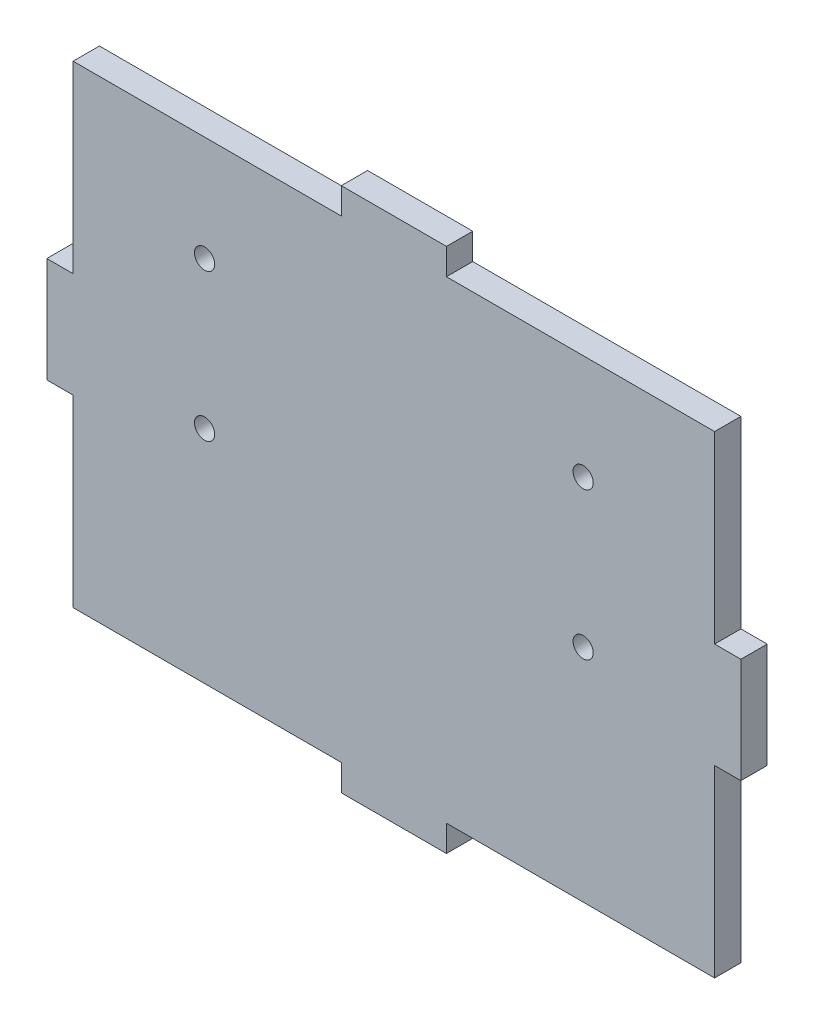
ISO-10303-21;
HEADER;
FILE_DESCRIPTION(('STEP AP214'),'2;1');
FILE_NAME('part.step','',(''),(''),'','','');
FILE_SCHEMA(('AUTOMOTIVE_DESIGN { 1 0 10303 214 1 1 1 1 }'));
ENDSEC;
DATA;
#1=APPLICATION_CONTEXT('core data for automotive mechanical design processes');
#2=APPLICATION_PROTOCOL_DEFINITION('international standard','automotive_design',2000,#1);
#3=PRODUCT_CONTEXT('',#1,'mechanical');
#4=PRODUCT('Part','Part','',(#3));
#5=PRODUCT_RELATED_PRODUCT_CATEGORY('part','',(#4));
#6=PRODUCT_DEFINITION_FORMATION('','',#4);
#7=PRODUCT_DEFINITION_CONTEXT('part definition',#1,'design');
#8=PRODUCT_DEFINITION('design','',#6,#7);
#9=PRODUCT_DEFINITION_SHAPE('','',#8);
#10=(LENGTH_UNIT() NAMED_UNIT(*) SI_UNIT(.MILLI.,.METRE.));
#11=(NAMED_UNIT(*) PLANE_ANGLE_UNIT() SI_UNIT($,.RADIAN.));
#12=(NAMED_UNIT(*) SI_UNIT($,.STERADIAN.) SOLID_ANGLE_UNIT());
#13=UNCERTAINTY_MEASURE_WITH_UNIT(LENGTH_MEASURE(1.E-05),#10,'distance_accuracy_value','');
#14=(GEOMETRIC_REPRESENTATION_CONTEXT(3) GLOBAL_UNCERTAINTY_ASSIGNED_CONTEXT((#13)) GLOBAL_UNIT_ASSIGNED_CONTEXT((#10,
#11,#12)) REPRESENTATION_CONTEXT('',''));
#15=CARTESIAN_POINT('',(0.,0.,0.));
#16=DIRECTION('',(0.,0.,1.));
#17=DIRECTION('',(1.,0.,0.));
#18=AXIS2_PLACEMENT_3D('',#15,#16,#17);
#19=CARTESIAN_POINT('',(38.735,6.35,3.175));
#20=DIRECTION('',(-1.,0.,0.));
#21=DIRECTION('',(0.,0.,1.));
#22=AXIS2_PLACEMENT_3D('',#19,#20,#21);
#23=PLANE('',#22);
#24=DIRECTION('',(0.,1.,0.));
#25=VECTOR('',#24,1.);
#26=CARTESIAN_POINT('',(38.735,6.35,0.));
#27=LINE('',#26,#25);
#28=CARTESIAN_POINT('',(38.735,6.35,0.));
#29=VERTEX_POINT('',#28);
#30=CARTESIAN_POINT('',(38.735,28.575,0.));
#31=VERTEX_POINT('',#30);
#32=EDGE_CURVE('E212',#29,#31,#27,.T.);
#33=ORIENTED_EDGE('',*,*,#32,.T.);
#34=DIRECTION('',(0.,0.,-1.));
#35=VECTOR('',#34,1.);
#36=CARTESIAN_POINT('',(38.735,28.575,3.175));
#37=LINE('',#36,#35);
#38=CARTESIAN_POINT('',(38.735,28.575,3.175));
#39=VERTEX_POINT('',#38);
#40=EDGE_CURVE('E11',#39,#31,#37,.T.);
#41=ORIENTED_EDGE('',*,*,#40,.F.);
#42=DIRECTION('',(0.,1.,0.));
#43=VECTOR('',#42,1.);
#44=CARTESIAN_POINT('',(38.735,6.35,3.175));
#45=LINE('',#44,#43);
#46=CARTESIAN_POINT('',(38.735,6.35,3.175));
#47=VERTEX_POINT('',#46);
#48=EDGE_CURVE('E271',#47,#39,#45,.T.);
#49=ORIENTED_EDGE('',*,*,#48,.F.);
#50=DIRECTION('',(0.,0.,-1.));
#51=VECTOR('',#50,1.);
#52=CARTESIAN_POINT('',(38.735,6.35,3.175));
#53=LINE('',#52,#51);
#54=EDGE_CURVE('E208',#47,#29,#53,.T.);
#55=ORIENTED_EDGE('',*,*,#54,.T.);
#56=EDGE_LOOP('',(#33,#41,#49,#55));
#57=FACE_BOUND('',#56,.T.);
#58=ADVANCED_FACE('F39',(#57),#23,.F.);
#59=CARTESIAN_POINT('',(6.34999999999999,28.575,3.175));
#60=DIRECTION('',(0.,-1.,0.));
#61=DIRECTION('',(0.,0.,-1.));
#62=AXIS2_PLACEMENT_3D('',#59,#60,#61);
#63=PLANE('',#62);
#64=DIRECTION('',(-1.,0.,0.));
#65=VECTOR('',#64,1.);
#66=CARTESIAN_POINT('',(6.34999999999999,28.575,0.));
#67=LINE('',#66,#65);
#68=CARTESIAN_POINT('',(6.34999999999999,28.575,0.));
#69=VERTEX_POINT('',#68);
#70=EDGE_CURVE('E216',#31,#69,#67,.T.);
#71=ORIENTED_EDGE('',*,*,#70,.T.);
#72=DIRECTION('',(0.,0.,-1.));
#73=VECTOR('',#72,1.);
#74=CARTESIAN_POINT('',(6.34999999999999,28.575,3.175));
#75=LINE('',#74,#73);
#76=CARTESIAN_POINT('',(6.34999999999999,28.575,3.175));
#77=VERTEX_POINT('',#76);
#78=EDGE_CURVE('E48',#77,#69,#75,.T.);
#79=ORIENTED_EDGE('',*,*,#78,.F.);
#80=DIRECTION('',(-1.,0.,0.));
#81=VECTOR('',#80,1.);
#82=CARTESIAN_POINT('',(6.34999999999999,28.575,3.175));
#83=LINE('',#82,#81);
#84=EDGE_CURVE('E135',#39,#77,#83,.T.);
#85=ORIENTED_EDGE('',*,*,#84,.F.);
#86=ORIENTED_EDGE('',*,*,#40,.T.);
#87=EDGE_LOOP('',(#71,#79,#85,#86));
#88=FACE_BOUND('',#87,.T.);
#89=ADVANCED_FACE('F422',(#88),#63,.F.);
#90=CARTESIAN_POINT('',(6.34999999999999,31.75,3.175));
#91=DIRECTION('',(-1.,0.,0.));
#92=DIRECTION('',(0.,0.,1.));
#93=AXIS2_PLACEMENT_3D('',#90,#91,#92);
#94=PLANE('',#93);
#95=DIRECTION('',(0.,1.,0.));
#96=VECTOR('',#95,1.);
#97=CARTESIAN_POINT('',(6.34999999999999,31.75,0.));
#98=LINE('',#97,#96);
#99=CARTESIAN_POINT('',(6.34999999999999,31.75,0.));
#100=VERTEX_POINT('',#99);
#101=EDGE_CURVE('E220',#69,#100,#98,.T.);
#102=ORIENTED_EDGE('',*,*,#101,.T.);
#103=DIRECTION('',(0.,0.,-1.));
#104=VECTOR('',#103,1.);
#105=CARTESIAN_POINT('',(6.34999999999999,31.75,3.175));
#106=LINE('',#105,#104);
#107=CARTESIAN_POINT('',(6.34999999999999,31.75,3.175));
#108=VERTEX_POINT('',#107);
#109=EDGE_CURVE('E330',#108,#100,#106,.T.);
#110=ORIENTED_EDGE('',*,*,#109,.F.);
#111=DIRECTION('',(0.,1.,0.));
#112=VECTOR('',#111,1.);
#113=CARTESIAN_POINT('',(6.34999999999999,31.75,3.175));
#114=LINE('',#113,#112);
#115=EDGE_CURVE('E340',#77,#108,#114,.T.);
#116=ORIENTED_EDGE('',*,*,#115,.F.);
#117=ORIENTED_EDGE('',*,*,#78,.T.);
#118=EDGE_LOOP('',(#102,#110,#116,#117));
#119=FACE_BOUND('',#118,.T.);
#120=ADVANCED_FACE('F338',(#119),#94,.F.);
#121=CARTESIAN_POINT('',(-6.35,31.75,3.175));
#122=DIRECTION('',(0.,-1.,0.));
#123=DIRECTION('',(0.,0.,-1.));
#124=AXIS2_PLACEMENT_3D('',#121,#122,#123);
#125=PLANE('',#124);
#126=DIRECTION('',(-1.,0.,0.));
#127=VECTOR('',#126,1.);
#128=CARTESIAN_POINT('',(-6.35,31.75,0.));
#129=LINE('',#128,#127);
#130=CARTESIAN_POINT('',(-6.35,31.75,0.));
#131=VERTEX_POINT('',#130);
#132=EDGE_CURVE('E223',#100,#131,#129,.T.);
#133=ORIENTED_EDGE('',*,*,#132,.T.);
#134=DIRECTION('',(0.,0.,-1.));
#135=VECTOR('',#134,1.);
#136=CARTESIAN_POINT('',(-6.35,31.75,3.175));
#137=LINE('',#136,#135);
#138=CARTESIAN_POINT('',(-6.35,31.75,3.175));
#139=VERTEX_POINT('',#138);
#140=EDGE_CURVE('E326',#139,#131,#137,.T.);
#141=ORIENTED_EDGE('',*,*,#140,.F.);
#142=DIRECTION('',(-1.,0.,0.));
#143=VECTOR('',#142,1.);
#144=CARTESIAN_POINT('',(-6.35,31.75,3.175));
#145=LINE('',#144,#143);
#146=EDGE_CURVE('E359',#108,#139,#145,.T.);
#147=ORIENTED_EDGE('',*,*,#146,.F.);
#148=ORIENTED_EDGE('',*,*,#109,.T.);
#149=EDGE_LOOP('',(#133,#141,#147,#148));
#150=FACE_BOUND('',#149,.T.);
#151=ADVANCED_FACE('F349',(#150),#125,.F.);
#152=CARTESIAN_POINT('',(-6.35,28.575,3.175));
#153=DIRECTION('',(1.,0.,0.));
#154=DIRECTION('',(0.,0.,-1.));
#155=AXIS2_PLACEMENT_3D('',#152,#153,#154);
#156=PLANE('',#155);
#157=DIRECTION('',(0.,-1.,0.));
#158=VECTOR('',#157,1.);
#159=CARTESIAN_POINT('',(-6.35,28.575,0.));
#160=LINE('',#159,#158);
#161=CARTESIAN_POINT('',(-6.35,28.575,0.));
#162=VERTEX_POINT('',#161);
#163=EDGE_CURVE('E226',#131,#162,#160,.T.);
#164=ORIENTED_EDGE('',*,*,#163,.T.);
#165=DIRECTION('',(0.,0.,-1.));
#166=VECTOR('',#165,1.);
#167=CARTESIAN_POINT('',(-6.35,28.575,3.175));
#168=LINE('',#167,#166);
#169=CARTESIAN_POINT('',(-6.35,28.575,3.175));
#170=VERTEX_POINT('',#169);
#171=EDGE_CURVE('E322',#170,#162,#168,.T.);
#172=ORIENTED_EDGE('',*,*,#171,.F.);
#173=DIRECTION('',(0.,-1.,0.));
#174=VECTOR('',#173,1.);
#175=CARTESIAN_POINT('',(-6.35,28.575,3.175));
#176=LINE('',#175,#174);
#177=EDGE_CURVE('E355',#139,#170,#176,.T.);
#178=ORIENTED_EDGE('',*,*,#177,.F.);
#179=ORIENTED_EDGE('',*,*,#140,.T.);
#180=EDGE_LOOP('',(#164,#172,#178,#179));
#181=FACE_BOUND('',#180,.T.);
#182=ADVANCED_FACE('F353',(#181),#156,.F.);
#183=CARTESIAN_POINT('',(-38.735,28.575,3.175));
#184=DIRECTION('',(0.,-1.,0.));
#185=DIRECTION('',(1.,0.,0.));
#186=AXIS2_PLACEMENT_3D('',#183,#184,#185);
#187=PLANE('',#186);
#188=DIRECTION('',(-1.,0.,0.));
#189=VECTOR('',#188,1.);
#190=CARTESIAN_POINT('',(-38.735,28.575,0.));
#191=LINE('',#190,#189);
#192=CARTESIAN_POINT('',(-38.735,28.575,0.));
#193=VERTEX_POINT('',#192);
#194=EDGE_CURVE('E229',#162,#193,#191,.T.);
#195=ORIENTED_EDGE('',*,*,#194,.T.);
#196=DIRECTION('',(0.,0.,-1.));
#197=VECTOR('',#196,1.);
#198=CARTESIAN_POINT('',(-38.735,28.575,3.175));
#199=LINE('',#198,#197);
#200=CARTESIAN_POINT('',(-38.735,28.575,3.175));
#201=VERTEX_POINT('',#200);
#202=EDGE_CURVE('E318',#201,#193,#199,.T.);
#203=ORIENTED_EDGE('',*,*,#202,.F.);
#204=DIRECTION('',(-1.,0.,0.));
#205=VECTOR('',#204,1.);
#206=CARTESIAN_POINT('',(-38.735,28.575,3.175));
#207=LINE('',#206,#205);
#208=EDGE_CURVE('E358',#170,#201,#207,.T.);
#209=ORIENTED_EDGE('',*,*,#208,.F.);
#210=ORIENTED_EDGE('',*,*,#171,.T.);
#211=EDGE_LOOP('',(#195,#203,#209,#210));
#212=FACE_BOUND('',#211,.T.);
#213=ADVANCED_FACE('F435',(#212),#187,.F.);
#214=CARTESIAN_POINT('',(-38.735,6.35000000000001,3.175));
#215=DIRECTION('',(1.,0.,0.));
#216=DIRECTION('',(0.,0.,-1.));
#217=AXIS2_PLACEMENT_3D('',#214,#215,#216);
#218=PLANE('',#217);
#219=DIRECTION('',(0.,-1.,0.));
#220=VECTOR('',#219,1.);
#221=CARTESIAN_POINT('',(-38.735,6.35000000000001,0.));
#222=LINE('',#221,#220);
#223=CARTESIAN_POINT('',(-38.735,6.35000000000001,0.));
#224=VERTEX_POINT('',#223);
#225=EDGE_CURVE('E232',#193,#224,#222,.T.);
#226=ORIENTED_EDGE('',*,*,#225,.T.);
#227=DIRECTION('',(0.,0.,-1.));
#228=VECTOR('',#227,1.);
#229=CARTESIAN_POINT('',(-38.735,6.35000000000001,3.175));
#230=LINE('',#229,#228);
#231=CARTESIAN_POINT('',(-38.735,6.35000000000001,3.175));
#232=VERTEX_POINT('',#231);
#233=EDGE_CURVE('E314',#232,#224,#230,.T.);
#234=ORIENTED_EDGE('',*,*,#233,.F.);
#235=DIRECTION('',(0.,-1.,0.));
#236=VECTOR('',#235,1.);
#237=CARTESIAN_POINT('',(-38.735,6.35000000000001,3.175));
#238=LINE('',#237,#236);
#239=EDGE_CURVE('E363',#201,#232,#238,.T.);
#240=ORIENTED_EDGE('',*,*,#239,.F.);
#241=ORIENTED_EDGE('',*,*,#202,.T.);
#242=EDGE_LOOP('',(#226,#234,#240,#241));
#243=FACE_BOUND('',#242,.T.);
#244=ADVANCED_FACE('F438',(#243),#218,.F.);
#245=CARTESIAN_POINT('',(-38.735,6.35000000000001,3.175));
#246=DIRECTION('',(0.,-1.,0.));
#247=DIRECTION('',(1.,0.,0.));
#248=AXIS2_PLACEMENT_3D('',#245,#246,#247);
#249=PLANE('',#248);
#250=DIRECTION('',(-1.,0.,0.));
#251=VECTOR('',#250,1.);
#252=CARTESIAN_POINT('',(-38.735,6.35000000000001,0.));
#253=LINE('',#252,#251);
#254=CARTESIAN_POINT('',(-41.91,6.34999999999999,0.));
#255=VERTEX_POINT('',#254);
#256=EDGE_CURVE('E235',#224,#255,#253,.T.);
#257=ORIENTED_EDGE('',*,*,#256,.T.);
#258=DIRECTION('',(0.,0.,-1.));
#259=VECTOR('',#258,1.);
#260=CARTESIAN_POINT('',(-41.91,6.34999999999999,3.175));
#261=LINE('',#260,#259);
#262=CARTESIAN_POINT('',(-41.91,6.34999999999999,3.175));
#263=VERTEX_POINT('',#262);
#264=EDGE_CURVE('E310',#263,#255,#261,.T.);
#265=ORIENTED_EDGE('',*,*,#264,.F.);
#266=DIRECTION('',(-1.,0.,0.));
#267=VECTOR('',#266,1.);
#268=CARTESIAN_POINT('',(-38.735,6.35000000000001,3.175));
#269=LINE('',#268,#267);
#270=EDGE_CURVE('E370',#232,#263,#269,.T.);
#271=ORIENTED_EDGE('',*,*,#270,.F.);
#272=ORIENTED_EDGE('',*,*,#233,.T.);
#273=EDGE_LOOP('',(#257,#265,#271,#272));
#274=FACE_BOUND('',#273,.T.);
#275=ADVANCED_FACE('F442',(#274),#249,.F.);
#276=CARTESIAN_POINT('',(-41.91,6.34999999999999,3.175));
#277=DIRECTION('',(1.,0.,0.));
#278=DIRECTION('',(0.,0.,-1.));
#279=AXIS2_PLACEMENT_3D('',#276,#277,#278);
#280=PLANE('',#279);
#281=DIRECTION('',(0.,-1.,0.));
#282=VECTOR('',#281,1.);
#283=CARTESIAN_POINT('',(-41.91,6.34999999999999,0.));
#284=LINE('',#283,#282);
#285=CARTESIAN_POINT('',(-41.91,-6.35,0.));
#286=VERTEX_POINT('',#285);
#287=EDGE_CURVE('E238',#255,#286,#284,.T.);
#288=ORIENTED_EDGE('',*,*,#287,.T.);
#289=DIRECTION('',(0.,0.,-1.));
#290=VECTOR('',#289,1.);
#291=CARTESIAN_POINT('',(-41.91,-6.35,3.175));
#292=LINE('',#291,#290);
#293=CARTESIAN_POINT('',(-41.91,-6.35,3.175));
#294=VERTEX_POINT('',#293);
#295=EDGE_CURVE('E306',#294,#286,#292,.T.);
#296=ORIENTED_EDGE('',*,*,#295,.F.);
#297=DIRECTION('',(0.,-1.,0.));
#298=VECTOR('',#297,1.);
#299=CARTESIAN_POINT('',(-41.91,6.34999999999999,3.175));
#300=LINE('',#299,#298);
#301=EDGE_CURVE('E373',#263,#294,#300,.T.);
#302=ORIENTED_EDGE('',*,*,#301,.F.);
#303=ORIENTED_EDGE('',*,*,#264,.T.);
#304=EDGE_LOOP('',(#288,#296,#302,#303));
#305=FACE_BOUND('',#304,.T.);
#306=ADVANCED_FACE('F446',(#305),#280,.F.);
#307=CARTESIAN_POINT('',(-41.91,-6.35,3.175));
#308=DIRECTION('',(0.,1.,0.));
#309=DIRECTION('',(-1.,0.,0.));
#310=AXIS2_PLACEMENT_3D('',#307,#308,#309);
#311=PLANE('',#310);
#312=DIRECTION('',(1.,0.,0.));
#313=VECTOR('',#312,1.);
#314=CARTESIAN_POINT('',(-41.91,-6.35,0.));
#315=LINE('',#314,#313);
#316=CARTESIAN_POINT('',(-38.735,-6.35,0.));
#317=VERTEX_POINT('',#316);
#318=EDGE_CURVE('E241',#286,#317,#315,.T.);
#319=ORIENTED_EDGE('',*,*,#318,.T.);
#320=DIRECTION('',(0.,0.,-1.));
#321=VECTOR('',#320,1.);
#322=CARTESIAN_POINT('',(-38.735,-6.35,3.175));
#323=LINE('',#322,#321);
#324=CARTESIAN_POINT('',(-38.735,-6.35,3.175));
#325=VERTEX_POINT('',#324);
#326=EDGE_CURVE('E302',#325,#317,#323,.T.);
#327=ORIENTED_EDGE('',*,*,#326,.F.);
#328=DIRECTION('',(1.,0.,0.));
#329=VECTOR('',#328,1.);
#330=CARTESIAN_POINT('',(-41.91,-6.35,3.175));
#331=LINE('',#330,#329);
#332=EDGE_CURVE('E376',#294,#325,#331,.T.);
#333=ORIENTED_EDGE('',*,*,#332,.F.);
#334=ORIENTED_EDGE('',*,*,#295,.T.);
#335=EDGE_LOOP('',(#319,#327,#333,#334));
#336=FACE_BOUND('',#335,.T.);
#337=ADVANCED_FACE('F450',(#336),#311,.F.);
#338=CARTESIAN_POINT('',(-38.735,-28.575,3.175));
#339=DIRECTION('',(1.,0.,0.));
#340=DIRECTION('',(0.,0.,-1.));
#341=AXIS2_PLACEMENT_3D('',#338,#339,#340);
#342=PLANE('',#341);
#343=DIRECTION('',(0.,-1.,0.));
#344=VECTOR('',#343,1.);
#345=CARTESIAN_POINT('',(-38.735,-28.575,0.));
#346=LINE('',#345,#344);
#347=CARTESIAN_POINT('',(-38.735,-28.575,0.));
#348=VERTEX_POINT('',#347);
#349=EDGE_CURVE('E244',#317,#348,#346,.T.);
#350=ORIENTED_EDGE('',*,*,#349,.T.);
#351=DIRECTION('',(0.,0.,-1.));
#352=VECTOR('',#351,1.);
#353=CARTESIAN_POINT('',(-38.735,-28.575,3.175));
#354=LINE('',#353,#352);
#355=CARTESIAN_POINT('',(-38.735,-28.575,3.175));
#356=VERTEX_POINT('',#355);
#357=EDGE_CURVE('E298',#356,#348,#354,.T.);
#358=ORIENTED_EDGE('',*,*,#357,.F.);
#359=DIRECTION('',(0.,-1.,0.));
#360=VECTOR('',#359,1.);
#361=CARTESIAN_POINT('',(-38.735,-28.575,3.175));
#362=LINE('',#361,#360);
#363=EDGE_CURVE('E379',#325,#356,#362,.T.);
#364=ORIENTED_EDGE('',*,*,#363,.F.);
#365=ORIENTED_EDGE('',*,*,#326,.T.);
#366=EDGE_LOOP('',(#350,#358,#364,#365));
#367=FACE_BOUND('',#366,.T.);
#368=ADVANCED_FACE('F454',(#367),#342,.F.);
#369=CARTESIAN_POINT('',(-38.735,-28.575,3.175));
#370=DIRECTION('',(0.,1.,0.));
#371=DIRECTION('',(0.,0.,1.));
#372=AXIS2_PLACEMENT_3D('',#369,#370,#371);
#373=PLANE('',#372);
#374=DIRECTION('',(1.,0.,0.));
#375=VECTOR('',#374,1.);
#376=CARTESIAN_POINT('',(-38.735,-28.575,0.));
#377=LINE('',#376,#375);
#378=CARTESIAN_POINT('',(-6.35000000000001,-28.575,0.));
#379=VERTEX_POINT('',#378);
#380=EDGE_CURVE('E247',#348,#379,#377,.T.);
#381=ORIENTED_EDGE('',*,*,#380,.T.);
#382=DIRECTION('',(0.,0.,-1.));
#383=VECTOR('',#382,1.);
#384=CARTESIAN_POINT('',(-6.35000000000001,-28.575,3.175));
#385=LINE('',#384,#383);
#386=CARTESIAN_POINT('',(-6.35000000000001,-28.575,3.175));
#387=VERTEX_POINT('',#386);
#388=EDGE_CURVE('E294',#387,#379,#385,.T.);
#389=ORIENTED_EDGE('',*,*,#388,.F.);
#390=DIRECTION('',(1.,0.,0.));
#391=VECTOR('',#390,1.);
#392=CARTESIAN_POINT('',(-38.735,-28.575,3.175));
#393=LINE('',#392,#391);
#394=EDGE_CURVE('E382',#356,#387,#393,.T.);
#395=ORIENTED_EDGE('',*,*,#394,.F.);
#396=ORIENTED_EDGE('',*,*,#357,.T.);
#397=EDGE_LOOP('',(#381,#389,#395,#396));
#398=FACE_BOUND('',#397,.T.);
#399=ADVANCED_FACE('F458',(#398),#373,.F.);
#400=CARTESIAN_POINT('',(-6.35000000000001,-28.575,3.175));
#401=DIRECTION('',(1.,0.,0.));
#402=DIRECTION('',(0.,0.,-1.));
#403=AXIS2_PLACEMENT_3D('',#400,#401,#402);
#404=PLANE('',#403);
#405=DIRECTION('',(0.,-1.,0.));
#406=VECTOR('',#405,1.);
#407=CARTESIAN_POINT('',(-6.35000000000001,-28.575,0.));
#408=LINE('',#407,#406);
#409=CARTESIAN_POINT('',(-6.35000000000001,-31.75,0.));
#410=VERTEX_POINT('',#409);
#411=EDGE_CURVE('E250',#379,#410,#408,.T.);
#412=ORIENTED_EDGE('',*,*,#411,.T.);
#413=DIRECTION('',(0.,0.,-1.));
#414=VECTOR('',#413,1.);
#415=CARTESIAN_POINT('',(-6.35000000000001,-31.75,3.175));
#416=LINE('',#415,#414);
#417=CARTESIAN_POINT('',(-6.35000000000001,-31.75,3.175));
#418=VERTEX_POINT('',#417);
#419=EDGE_CURVE('E290',#418,#410,#416,.T.);
#420=ORIENTED_EDGE('',*,*,#419,.F.);
#421=DIRECTION('',(0.,-1.,0.));
#422=VECTOR('',#421,1.);
#423=CARTESIAN_POINT('',(-6.35000000000001,-28.575,3.175));
#424=LINE('',#423,#422);
#425=EDGE_CURVE('E385',#387,#418,#424,.T.);
#426=ORIENTED_EDGE('',*,*,#425,.F.);
#427=ORIENTED_EDGE('',*,*,#388,.T.);
#428=EDGE_LOOP('',(#412,#420,#426,#427));
#429=FACE_BOUND('',#428,.T.);
#430=ADVANCED_FACE('F462',(#429),#404,.F.);
#431=CARTESIAN_POINT('',(-6.35000000000001,-31.75,3.175));
#432=DIRECTION('',(0.,1.,0.));
#433=DIRECTION('',(-1.,0.,0.));
#434=AXIS2_PLACEMENT_3D('',#431,#432,#433);
#435=PLANE('',#434);
#436=DIRECTION('',(1.,0.,0.));
#437=VECTOR('',#436,1.);
#438=CARTESIAN_POINT('',(-6.35000000000001,-31.75,0.));
#439=LINE('',#438,#437);
#440=CARTESIAN_POINT('',(6.34999999999999,-31.75,0.));
#441=VERTEX_POINT('',#440);
#442=EDGE_CURVE('E253',#410,#441,#439,.T.);
#443=ORIENTED_EDGE('',*,*,#442,.T.);
#444=DIRECTION('',(0.,0.,-1.));
#445=VECTOR('',#444,1.);
#446=CARTESIAN_POINT('',(6.34999999999999,-31.75,3.175));
#447=LINE('',#446,#445);
#448=CARTESIAN_POINT('',(6.34999999999999,-31.75,3.175));
#449=VERTEX_POINT('',#448);
#450=EDGE_CURVE('E286',#449,#441,#447,.T.);
#451=ORIENTED_EDGE('',*,*,#450,.F.);
#452=DIRECTION('',(1.,0.,0.));
#453=VECTOR('',#452,1.);
#454=CARTESIAN_POINT('',(-6.35000000000001,-31.75,3.175));
#455=LINE('',#454,#453);
#456=EDGE_CURVE('E388',#418,#449,#455,.T.);
#457=ORIENTED_EDGE('',*,*,#456,.F.);
#458=ORIENTED_EDGE('',*,*,#419,.T.);
#459=EDGE_LOOP('',(#443,#451,#457,#458));
#460=FACE_BOUND('',#459,.T.);
#461=ADVANCED_FACE('F466',(#460),#435,.F.);
#462=CARTESIAN_POINT('',(6.34999999999999,-31.75,3.175));
#463=DIRECTION('',(-1.,0.,0.));
#464=DIRECTION('',(0.,0.,1.));
#465=AXIS2_PLACEMENT_3D('',#462,#463,#464);
#466=PLANE('',#465);
#467=DIRECTION('',(0.,1.,0.));
#468=VECTOR('',#467,1.);
#469=CARTESIAN_POINT('',(6.34999999999999,-31.75,0.));
#470=LINE('',#469,#468);
#471=CARTESIAN_POINT('',(6.34999999999999,-28.575,0.));
#472=VERTEX_POINT('',#471);
#473=EDGE_CURVE('E256',#441,#472,#470,.T.);
#474=ORIENTED_EDGE('',*,*,#473,.T.);
#475=DIRECTION('',(0.,0.,-1.));
#476=VECTOR('',#475,1.);
#477=CARTESIAN_POINT('',(6.34999999999999,-28.575,3.175));
#478=LINE('',#477,#476);
#479=CARTESIAN_POINT('',(6.34999999999999,-28.575,3.175));
#480=VERTEX_POINT('',#479);
#481=EDGE_CURVE('E282',#480,#472,#478,.T.);
#482=ORIENTED_EDGE('',*,*,#481,.F.);
#483=DIRECTION('',(0.,1.,0.));
#484=VECTOR('',#483,1.);
#485=CARTESIAN_POINT('',(6.34999999999999,-31.75,3.175));
#486=LINE('',#485,#484);
#487=EDGE_CURVE('E391',#449,#480,#486,.T.);
#488=ORIENTED_EDGE('',*,*,#487,.F.);
#489=ORIENTED_EDGE('',*,*,#450,.T.);
#490=EDGE_LOOP('',(#474,#482,#488,#489));
#491=FACE_BOUND('',#490,.T.);
#492=ADVANCED_FACE('F470',(#491),#466,.F.);
#493=CARTESIAN_POINT('',(6.34999999999999,-28.575,3.175));
#494=DIRECTION('',(0.,1.,0.));
#495=DIRECTION('',(0.,0.,1.));
#496=AXIS2_PLACEMENT_3D('',#493,#494,#495);
#497=PLANE('',#496);
#498=DIRECTION('',(1.,0.,0.));
#499=VECTOR('',#498,1.);
#500=CARTESIAN_POINT('',(6.34999999999999,-28.575,0.));
#501=LINE('',#500,#499);
#502=CARTESIAN_POINT('',(38.735,-28.575,0.));
#503=VERTEX_POINT('',#502);
#504=EDGE_CURVE('E259',#472,#503,#501,.T.);
#505=ORIENTED_EDGE('',*,*,#504,.T.);
#506=DIRECTION('',(0.,0.,-1.));
#507=VECTOR('',#506,1.);
#508=CARTESIAN_POINT('',(38.735,-28.575,3.175));
#509=LINE('',#508,#507);
#510=CARTESIAN_POINT('',(38.735,-28.575,3.175));
#511=VERTEX_POINT('',#510);
#512=EDGE_CURVE('E278',#511,#503,#509,.T.);
#513=ORIENTED_EDGE('',*,*,#512,.F.);
#514=DIRECTION('',(1.,0.,0.));
#515=VECTOR('',#514,1.);
#516=CARTESIAN_POINT('',(6.34999999999999,-28.575,3.175));
#517=LINE('',#516,#515);
#518=EDGE_CURVE('E394',#480,#511,#517,.T.);
#519=ORIENTED_EDGE('',*,*,#518,.F.);
#520=ORIENTED_EDGE('',*,*,#481,.T.);
#521=EDGE_LOOP('',(#505,#513,#519,#520));
#522=FACE_BOUND('',#521,.T.);
#523=ADVANCED_FACE('F402',(#522),#497,.F.);
#524=CARTESIAN_POINT('',(38.735,-28.575,3.175));
#525=DIRECTION('',(-1.,0.,0.));
#526=DIRECTION('',(0.,0.,1.));
#527=AXIS2_PLACEMENT_3D('',#524,#525,#526);
#528=PLANE('',#527);
#529=DIRECTION('',(0.,1.,0.));
#530=VECTOR('',#529,1.);
#531=CARTESIAN_POINT('',(38.735,-28.575,0.));
#532=LINE('',#531,#530);
#533=CARTESIAN_POINT('',(38.735,-6.35,0.));
#534=VERTEX_POINT('',#533);
#535=EDGE_CURVE('E262',#503,#534,#532,.T.);
#536=ORIENTED_EDGE('',*,*,#535,.T.);
#537=DIRECTION('',(0.,0.,-1.));
#538=VECTOR('',#537,1.);
#539=CARTESIAN_POINT('',(38.735,-6.35,3.175));
#540=LINE('',#539,#538);
#541=CARTESIAN_POINT('',(38.735,-6.35,3.175));
#542=VERTEX_POINT('',#541);
#543=EDGE_CURVE('E201',#542,#534,#540,.T.);
#544=ORIENTED_EDGE('',*,*,#543,.F.);
#545=DIRECTION('',(0.,1.,0.));
#546=VECTOR('',#545,1.);
#547=CARTESIAN_POINT('',(38.735,-28.575,3.175));
#548=LINE('',#547,#546);
#549=EDGE_CURVE('E190',#511,#542,#548,.T.);
#550=ORIENTED_EDGE('',*,*,#549,.F.);
#551=ORIENTED_EDGE('',*,*,#512,.T.);
#552=EDGE_LOOP('',(#536,#544,#550,#551));
#553=FACE_BOUND('',#552,.T.);
#554=ADVANCED_FACE('F406',(#553),#528,.F.);
#555=CARTESIAN_POINT('',(41.91,-6.35,3.175));
#556=DIRECTION('',(0.,1.,0.));
#557=DIRECTION('',(-1.,0.,0.));
#558=AXIS2_PLACEMENT_3D('',#555,#556,#557);
#559=PLANE('',#558);
#560=DIRECTION('',(1.,0.,0.));
#561=VECTOR('',#560,1.);
#562=CARTESIAN_POINT('',(41.91,-6.35,0.));
#563=LINE('',#562,#561);
#564=CARTESIAN_POINT('',(41.91,-6.35,0.));
#565=VERTEX_POINT('',#564);
#566=EDGE_CURVE('E199',#534,#565,#563,.T.);
#567=ORIENTED_EDGE('',*,*,#566,.T.);
#568=DIRECTION('',(0.,0.,-1.));
#569=VECTOR('',#568,1.);
#570=CARTESIAN_POINT('',(41.91,-6.35,3.175));
#571=LINE('',#570,#569);
#572=CARTESIAN_POINT('',(41.91,-6.35,3.175));
#573=VERTEX_POINT('',#572);
#574=EDGE_CURVE('E196',#573,#565,#571,.T.);
#575=ORIENTED_EDGE('',*,*,#574,.F.);
#576=DIRECTION('',(1.,0.,0.));
#577=VECTOR('',#576,1.);
#578=CARTESIAN_POINT('',(41.91,-6.35,3.175));
#579=LINE('',#578,#577);
#580=EDGE_CURVE('E184',#542,#573,#579,.T.);
#581=ORIENTED_EDGE('',*,*,#580,.F.);
#582=ORIENTED_EDGE('',*,*,#543,.T.);
#583=EDGE_LOOP('',(#567,#575,#581,#582));
#584=FACE_BOUND('',#583,.T.);
#585=ADVANCED_FACE('F197',(#584),#559,.F.);
#586=CARTESIAN_POINT('',(41.91,6.35,3.175));
#587=DIRECTION('',(-1.,0.,0.));
#588=DIRECTION('',(0.,0.,1.));
#589=AXIS2_PLACEMENT_3D('',#586,#587,#588);
#590=PLANE('',#589);
#591=DIRECTION('',(0.,1.,0.));
#592=VECTOR('',#591,1.);
#593=CARTESIAN_POINT('',(41.91,6.35,0.));
#594=LINE('',#593,#592);
#595=CARTESIAN_POINT('',(41.91,6.35,0.));
#596=VERTEX_POINT('',#595);
#597=EDGE_CURVE('E121',#565,#596,#594,.T.);
#598=ORIENTED_EDGE('',*,*,#597,.T.);
#599=DIRECTION('',(0.,0.,-1.));
#600=VECTOR('',#599,1.);
#601=CARTESIAN_POINT('',(41.91,6.35,3.175));
#602=LINE('',#601,#600);
#603=CARTESIAN_POINT('',(41.91,6.35,3.175));
#604=VERTEX_POINT('',#603);
#605=EDGE_CURVE('E202',#604,#596,#602,.T.);
#606=ORIENTED_EDGE('',*,*,#605,.F.);
#607=DIRECTION('',(0.,1.,0.));
#608=VECTOR('',#607,1.);
#609=CARTESIAN_POINT('',(41.91,6.35,3.175));
#610=LINE('',#609,#608);
#611=EDGE_CURVE('E188',#573,#604,#610,.T.);
#612=ORIENTED_EDGE('',*,*,#611,.F.);
#613=ORIENTED_EDGE('',*,*,#574,.T.);
#614=EDGE_LOOP('',(#598,#606,#612,#613));
#615=FACE_BOUND('',#614,.T.);
#616=ADVANCED_FACE('F204',(#615),#590,.F.);
#617=CARTESIAN_POINT('',(38.735,6.35,3.175));
#618=DIRECTION('',(0.,-1.,0.));
#619=DIRECTION('',(1.,0.,0.));
#620=AXIS2_PLACEMENT_3D('',#617,#618,#619);
#621=PLANE('',#620);
#622=DIRECTION('',(-1.,0.,0.));
#623=VECTOR('',#622,1.);
#624=CARTESIAN_POINT('',(38.735,6.35,0.));
#625=LINE('',#624,#623);
#626=EDGE_CURVE('E127',#596,#29,#625,.T.);
#627=ORIENTED_EDGE('',*,*,#626,.T.);
#628=ORIENTED_EDGE('',*,*,#54,.F.);
#629=DIRECTION('',(-1.,0.,0.));
#630=VECTOR('',#629,1.);
#631=CARTESIAN_POINT('',(38.735,6.35,3.175));
#632=LINE('',#631,#630);
#633=EDGE_CURVE('E56',#604,#47,#632,.T.);
#634=ORIENTED_EDGE('',*,*,#633,.F.);
#635=ORIENTED_EDGE('',*,*,#605,.T.);
#636=EDGE_LOOP('',(#627,#628,#634,#635));
#637=FACE_BOUND('',#636,.T.);
#638=ADVANCED_FACE('F410',(#637),#621,.F.);
#639=CARTESIAN_POINT('',(0.,0.,3.175));
#640=DIRECTION('',(0.,0.,-1.));
#641=DIRECTION('',(-1.,0.,0.));
#642=AXIS2_PLACEMENT_3D('',#639,#640,#641);
#643=PLANE('',#642);
#644=CARTESIAN_POINT('',(-22.86,-1.90500000000001,3.175));
#645=DIRECTION('',(0.,0.,1.));
#646=DIRECTION('',(1.,0.,0.));
#647=AXIS2_PLACEMENT_3D('',#644,#645,#646);
#648=CIRCLE('',#647,1.2192);
#649=CARTESIAN_POINT('',(-21.6408,-1.90500000000001,3.175));
#650=VERTEX_POINT('',#649);
#651=EDGE_CURVE('E556',#650,#650,#648,.T.);
#652=ORIENTED_EDGE('',*,*,#651,.F.);
#653=EDGE_LOOP('',(#652));
#654=FACE_BOUND('',#653,.T.);
#655=CARTESIAN_POINT('',(22.86,-1.90500000000001,3.175));
#656=DIRECTION('',(0.,0.,1.));
#657=DIRECTION('',(1.,0.,0.));
#658=AXIS2_PLACEMENT_3D('',#655,#656,#657);
#659=CIRCLE('',#658,1.2192);
#660=CARTESIAN_POINT('',(24.0792,-1.90500000000001,3.175));
#661=VERTEX_POINT('',#660);
#662=EDGE_CURVE('E560',#661,#661,#659,.T.);
#663=ORIENTED_EDGE('',*,*,#662,.F.);
#664=EDGE_LOOP('',(#663));
#665=FACE_BOUND('',#664,.T.);
#666=CARTESIAN_POINT('',(22.86,15.875,3.175));
#667=DIRECTION('',(0.,0.,1.));
#668=DIRECTION('',(1.,0.,0.));
#669=AXIS2_PLACEMENT_3D('',#666,#667,#668);
#670=CIRCLE('',#669,1.2192);
#671=CARTESIAN_POINT('',(24.0792,15.875,3.175));
#672=VERTEX_POINT('',#671);
#673=EDGE_CURVE('E579',#672,#672,#670,.T.);
#674=ORIENTED_EDGE('',*,*,#673,.F.);
#675=EDGE_LOOP('',(#674));
#676=FACE_BOUND('',#675,.T.);
#677=CARTESIAN_POINT('',(-22.86,15.875,3.175));
#678=DIRECTION('',(0.,0.,1.));
#679=DIRECTION('',(1.,0.,0.));
#680=AXIS2_PLACEMENT_3D('',#677,#678,#679);
#681=CIRCLE('',#680,1.2192);
#682=CARTESIAN_POINT('',(-21.6408,15.875,3.175));
#683=VERTEX_POINT('',#682);
#684=EDGE_CURVE('E567',#683,#683,#681,.T.);
#685=ORIENTED_EDGE('',*,*,#684,.F.);
#686=EDGE_LOOP('',(#685));
#687=FACE_BOUND('',#686,.T.);
#688=ORIENTED_EDGE('',*,*,#48,.T.);
#689=ORIENTED_EDGE('',*,*,#84,.T.);
#690=ORIENTED_EDGE('',*,*,#115,.T.);
#691=ORIENTED_EDGE('',*,*,#146,.T.);
#692=ORIENTED_EDGE('',*,*,#177,.T.);
#693=ORIENTED_EDGE('',*,*,#208,.T.);
#694=ORIENTED_EDGE('',*,*,#239,.T.);
#695=ORIENTED_EDGE('',*,*,#270,.T.);
#696=ORIENTED_EDGE('',*,*,#301,.T.);
#697=ORIENTED_EDGE('',*,*,#332,.T.);
#698=ORIENTED_EDGE('',*,*,#363,.T.);
#699=ORIENTED_EDGE('',*,*,#394,.T.);
#700=ORIENTED_EDGE('',*,*,#425,.T.);
#701=ORIENTED_EDGE('',*,*,#456,.T.);
#702=ORIENTED_EDGE('',*,*,#487,.T.);
#703=ORIENTED_EDGE('',*,*,#518,.T.);
#704=ORIENTED_EDGE('',*,*,#549,.T.);
#705=ORIENTED_EDGE('',*,*,#580,.T.);
#706=ORIENTED_EDGE('',*,*,#611,.T.);
#707=ORIENTED_EDGE('',*,*,#633,.T.);
#708=EDGE_LOOP('',(#688,#689,#690,#691,#692,#693,#694,#695,#696,#697,#698,#699,#700,#701,#702,
#703,#704,#705,#706,#707));
#709=FACE_BOUND('',#708,.T.);
#710=ADVANCED_FACE('F186',(#654,#665,#676,#687,#709),#643,.F.);
#711=CARTESIAN_POINT('',(0.,0.,0.));
#712=DIRECTION('',(0.,0.,-1.));
#713=DIRECTION('',(-1.,0.,0.));
#714=AXIS2_PLACEMENT_3D('',#711,#712,#713);
#715=PLANE('',#714);
#716=CARTESIAN_POINT('',(-22.86,-1.90500000000001,0.));
#717=DIRECTION('',(0.,0.,1.));
#718=DIRECTION('',(1.,0.,0.));
#719=AXIS2_PLACEMENT_3D('',#716,#717,#718);
#720=CIRCLE('',#719,1.2192);
#721=CARTESIAN_POINT('',(-21.6408,-1.90500000000001,0.));
#722=VERTEX_POINT('',#721);
#723=EDGE_CURVE('E553',#722,#722,#720,.T.);
#724=ORIENTED_EDGE('',*,*,#723,.T.);
#725=EDGE_LOOP('',(#724));
#726=FACE_BOUND('',#725,.T.);
#727=CARTESIAN_POINT('',(22.86,-1.90500000000001,0.));
#728=DIRECTION('',(0.,0.,1.));
#729=DIRECTION('',(1.,0.,0.));
#730=AXIS2_PLACEMENT_3D('',#727,#728,#729);
#731=CIRCLE('',#730,1.2192);
#732=CARTESIAN_POINT('',(24.0792,-1.90500000000001,0.));
#733=VERTEX_POINT('',#732);
#734=EDGE_CURVE('E583',#733,#733,#731,.T.);
#735=ORIENTED_EDGE('',*,*,#734,.T.);
#736=EDGE_LOOP('',(#735));
#737=FACE_BOUND('',#736,.T.);
#738=CARTESIAN_POINT('',(22.86,15.875,0.));
#739=DIRECTION('',(0.,0.,1.));
#740=DIRECTION('',(1.,0.,0.));
#741=AXIS2_PLACEMENT_3D('',#738,#739,#740);
#742=CIRCLE('',#741,1.2192);
#743=CARTESIAN_POINT('',(24.0792,15.875,0.));
#744=VERTEX_POINT('',#743);
#745=EDGE_CURVE('E571',#744,#744,#742,.T.);
#746=ORIENTED_EDGE('',*,*,#745,.T.);
#747=EDGE_LOOP('',(#746));
#748=FACE_BOUND('',#747,.T.);
#749=CARTESIAN_POINT('',(-22.86,15.875,0.));
#750=DIRECTION('',(0.,0.,1.));
#751=DIRECTION('',(1.,0.,0.));
#752=AXIS2_PLACEMENT_3D('',#749,#750,#751);
#753=CIRCLE('',#752,1.2192);
#754=CARTESIAN_POINT('',(-21.6408,15.875,0.));
#755=VERTEX_POINT('',#754);
#756=EDGE_CURVE('E217',#755,#755,#753,.T.);
#757=ORIENTED_EDGE('',*,*,#756,.T.);
#758=EDGE_LOOP('',(#757));
#759=FACE_BOUND('',#758,.T.);
#760=ORIENTED_EDGE('',*,*,#32,.F.);
#761=ORIENTED_EDGE('',*,*,#626,.F.);
#762=ORIENTED_EDGE('',*,*,#597,.F.);
#763=ORIENTED_EDGE('',*,*,#566,.F.);
#764=ORIENTED_EDGE('',*,*,#535,.F.);
#765=ORIENTED_EDGE('',*,*,#504,.F.);
#766=ORIENTED_EDGE('',*,*,#473,.F.);
#767=ORIENTED_EDGE('',*,*,#442,.F.);
#768=ORIENTED_EDGE('',*,*,#411,.F.);
#769=ORIENTED_EDGE('',*,*,#380,.F.);
#770=ORIENTED_EDGE('',*,*,#349,.F.);
#771=ORIENTED_EDGE('',*,*,#318,.F.);
#772=ORIENTED_EDGE('',*,*,#287,.F.);
#773=ORIENTED_EDGE('',*,*,#256,.F.);
#774=ORIENTED_EDGE('',*,*,#225,.F.);
#775=ORIENTED_EDGE('',*,*,#194,.F.);
#776=ORIENTED_EDGE('',*,*,#163,.F.);
#777=ORIENTED_EDGE('',*,*,#132,.F.);
#778=ORIENTED_EDGE('',*,*,#101,.F.);
#779=ORIENTED_EDGE('',*,*,#70,.F.);
#780=EDGE_LOOP('',(#760,#761,#762,#763,#764,#765,#766,#767,#768,#769,#770,#771,#772,#773,#774,
#775,#776,#777,#778,#779));
#781=FACE_BOUND('',#780,.T.);
#782=ADVANCED_FACE('F344',(#726,#737,#748,#759,#781),#715,.T.);
#783=CARTESIAN_POINT('',(-22.86,15.875,0.));
#784=DIRECTION('',(0.,0.,1.));
#785=DIRECTION('',(1.,0.,0.));
#786=AXIS2_PLACEMENT_3D('',#783,#784,#785);
#787=CYLINDRICAL_SURFACE('',#786,1.2192);
#788=ORIENTED_EDGE('',*,*,#756,.F.);
#789=EDGE_LOOP('',(#788));
#790=FACE_BOUND('',#789,.T.);
#791=ORIENTED_EDGE('',*,*,#684,.T.);
#792=EDGE_LOOP('',(#791));
#793=FACE_BOUND('',#792,.T.);
#794=ADVANCED_FACE('F507',(#790,#793),#787,.F.);
#795=CARTESIAN_POINT('',(22.86,15.875,0.));
#796=DIRECTION('',(0.,0.,1.));
#797=DIRECTION('',(1.,0.,0.));
#798=AXIS2_PLACEMENT_3D('',#795,#796,#797);
#799=CYLINDRICAL_SURFACE('',#798,1.2192);
#800=ORIENTED_EDGE('',*,*,#745,.F.);
#801=EDGE_LOOP('',(#800));
#802=FACE_BOUND('',#801,.T.);
#803=ORIENTED_EDGE('',*,*,#673,.T.);
#804=EDGE_LOOP('',(#803));
#805=FACE_BOUND('',#804,.T.);
#806=ADVANCED_FACE('F516',(#802,#805),#799,.F.);
#807=CARTESIAN_POINT('',(22.86,-1.90500000000001,0.));
#808=DIRECTION('',(0.,0.,1.));
#809=DIRECTION('',(1.,0.,0.));
#810=AXIS2_PLACEMENT_3D('',#807,#808,#809);
#811=CYLINDRICAL_SURFACE('',#810,1.2192);
#812=ORIENTED_EDGE('',*,*,#734,.F.);
#813=EDGE_LOOP('',(#812));
#814=FACE_BOUND('',#813,.T.);
#815=ORIENTED_EDGE('',*,*,#662,.T.);
#816=EDGE_LOOP('',(#815));
#817=FACE_BOUND('',#816,.T.);
#818=ADVANCED_FACE('F526',(#814,#817),#811,.F.);
#819=CARTESIAN_POINT('',(-22.86,-1.90500000000001,0.));
#820=DIRECTION('',(0.,0.,1.));
#821=DIRECTION('',(1.,0.,0.));
#822=AXIS2_PLACEMENT_3D('',#819,#820,#821);
#823=CYLINDRICAL_SURFACE('',#822,1.2192);
#824=ORIENTED_EDGE('',*,*,#723,.F.);
#825=EDGE_LOOP('',(#824));
#826=FACE_BOUND('',#825,.T.);
#827=ORIENTED_EDGE('',*,*,#651,.T.);
#828=EDGE_LOOP('',(#827));
#829=FACE_BOUND('',#828,.T.);
#830=ADVANCED_FACE('F536',(#826,#829),#823,.F.);
#831=CLOSED_SHELL('',(#58,#89,#120,#151,#182,#213,#244,#275,#306,#337,#368,#399,#430,#461,#492,
#523,#554,#585,#616,#638,#710,#782,#794,#806,#818,#830));
#832=MANIFOLD_SOLID_BREP('B2',#831);
#833=ADVANCED_BREP_SHAPE_REPRESENTATION('',(#18,#832),#14);
#834=SHAPE_DEFINITION_REPRESENTATION(#9,#833);
ENDSEC;
END-ISO-10303-21;
